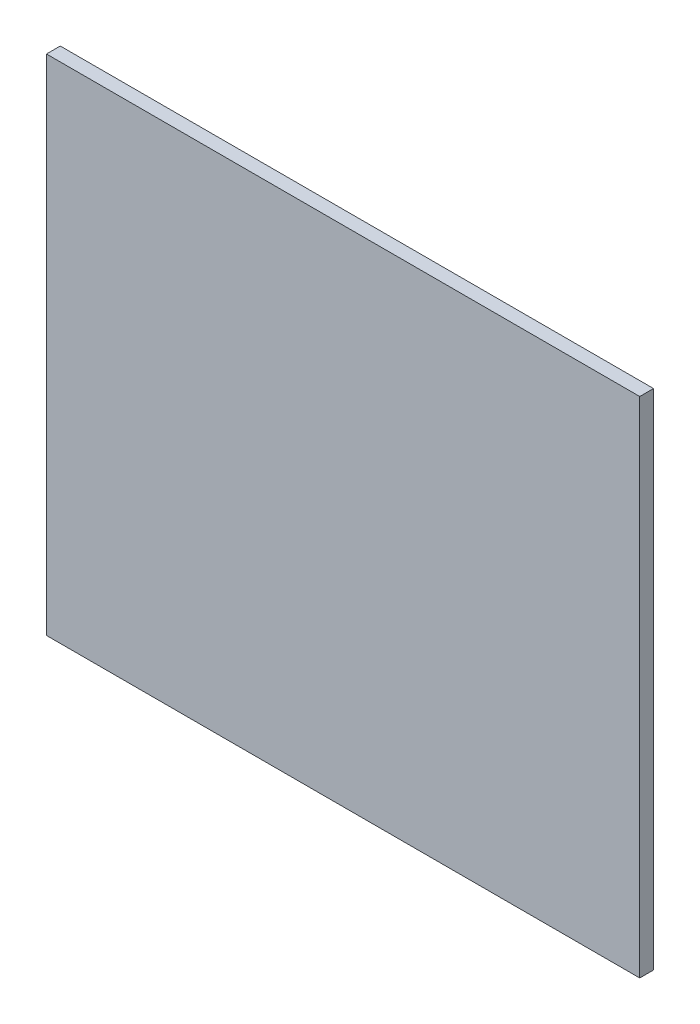
ISO-10303-21;
HEADER;
FILE_DESCRIPTION(('STEP AP214'),'2;1');
FILE_NAME('part.step','',(''),(''),'','','');
FILE_SCHEMA(('AUTOMOTIVE_DESIGN { 1 0 10303 214 1 1 1 1 }'));
ENDSEC;
DATA;
#1=APPLICATION_CONTEXT('core data for automotive mechanical design processes');
#2=APPLICATION_PROTOCOL_DEFINITION('international standard','automotive_design',2000,#1);
#3=PRODUCT_CONTEXT('',#1,'mechanical');
#4=PRODUCT('Part','Part','',(#3));
#5=PRODUCT_RELATED_PRODUCT_CATEGORY('part','',(#4));
#6=PRODUCT_DEFINITION_FORMATION('','',#4);
#7=PRODUCT_DEFINITION_CONTEXT('part definition',#1,'design');
#8=PRODUCT_DEFINITION('design','',#6,#7);
#9=PRODUCT_DEFINITION_SHAPE('','',#8);
#10=(LENGTH_UNIT() NAMED_UNIT(*) SI_UNIT(.MILLI.,.METRE.));
#11=(NAMED_UNIT(*) PLANE_ANGLE_UNIT() SI_UNIT($,.RADIAN.));
#12=(NAMED_UNIT(*) SI_UNIT($,.STERADIAN.) SOLID_ANGLE_UNIT());
#13=UNCERTAINTY_MEASURE_WITH_UNIT(LENGTH_MEASURE(1.E-05),#10,'distance_accuracy_value','');
#14=(GEOMETRIC_REPRESENTATION_CONTEXT(3) GLOBAL_UNCERTAINTY_ASSIGNED_CONTEXT((#13)) GLOBAL_UNIT_ASSIGNED_CONTEXT((#10,
#11,#12)) REPRESENTATION_CONTEXT('',''));
#15=CARTESIAN_POINT('',(0.,0.,0.));
#16=DIRECTION('',(0.,0.,1.));
#17=DIRECTION('',(1.,0.,0.));
#18=AXIS2_PLACEMENT_3D('',#15,#16,#17);
#19=CARTESIAN_POINT('',(2.15,0.,0.05));
#20=DIRECTION('',(-1.,0.,0.));
#21=DIRECTION('',(0.,0.,1.));
#22=AXIS2_PLACEMENT_3D('',#19,#20,#21);
#23=PLANE('',#22);
#24=DIRECTION('',(0.,0.,-1.));
#25=VECTOR('',#24,1.);
#26=CARTESIAN_POINT('',(2.15,-1.825,0.05));
#27=LINE('',#26,#25);
#28=CARTESIAN_POINT('',(2.15,-1.825,0.1));
#29=VERTEX_POINT('',#28);
#30=CARTESIAN_POINT('',(2.15,-1.825,0.));
#31=VERTEX_POINT('',#30);
#32=EDGE_CURVE('E72',#29,#31,#27,.T.);
#33=ORIENTED_EDGE('',*,*,#32,.T.);
#34=DIRECTION('',(0.,-1.,0.));
#35=VECTOR('',#34,1.);
#36=CARTESIAN_POINT('',(2.15,0.,0.));
#37=LINE('',#36,#35);
#38=CARTESIAN_POINT('',(2.15,1.825,0.));
#39=VERTEX_POINT('',#38);
#40=EDGE_CURVE('E115',#39,#31,#37,.T.);
#41=ORIENTED_EDGE('',*,*,#40,.F.);
#42=DIRECTION('',(0.,0.,-1.));
#43=VECTOR('',#42,1.);
#44=CARTESIAN_POINT('',(2.15,1.825,0.05));
#45=LINE('',#44,#43);
#46=CARTESIAN_POINT('',(2.15,1.825,0.1));
#47=VERTEX_POINT('',#46);
#48=EDGE_CURVE('E11',#47,#39,#45,.T.);
#49=ORIENTED_EDGE('',*,*,#48,.F.);
#50=DIRECTION('',(0.,1.,0.));
#51=VECTOR('',#50,1.);
#52=CARTESIAN_POINT('',(2.15,0.,0.1));
#53=LINE('',#52,#51);
#54=EDGE_CURVE('E85',#29,#47,#53,.T.);
#55=ORIENTED_EDGE('',*,*,#54,.F.);
#56=EDGE_LOOP('',(#33,#41,#49,#55));
#57=FACE_BOUND('',#56,.T.);
#58=ADVANCED_FACE('F16',(#57),#23,.F.);
#59=CARTESIAN_POINT('',(0.,1.825,0.05));
#60=DIRECTION('',(0.,-1.,0.));
#61=DIRECTION('',(0.,0.,-1.));
#62=AXIS2_PLACEMENT_3D('',#59,#60,#61);
#63=PLANE('',#62);
#64=ORIENTED_EDGE('',*,*,#48,.T.);
#65=DIRECTION('',(1.,0.,0.));
#66=VECTOR('',#65,1.);
#67=CARTESIAN_POINT('',(0.,1.825,0.));
#68=LINE('',#67,#66);
#69=CARTESIAN_POINT('',(-2.15,1.825,0.));
#70=VERTEX_POINT('',#69);
#71=EDGE_CURVE('E69',#70,#39,#68,.T.);
#72=ORIENTED_EDGE('',*,*,#71,.F.);
#73=DIRECTION('',(0.,0.,-1.));
#74=VECTOR('',#73,1.);
#75=CARTESIAN_POINT('',(-2.15,1.825,0.05));
#76=LINE('',#75,#74);
#77=CARTESIAN_POINT('',(-2.15,1.825,0.1));
#78=VERTEX_POINT('',#77);
#79=EDGE_CURVE('E26',#78,#70,#76,.T.);
#80=ORIENTED_EDGE('',*,*,#79,.F.);
#81=DIRECTION('',(-1.,0.,0.));
#82=VECTOR('',#81,1.);
#83=CARTESIAN_POINT('',(0.,1.825,0.1));
#84=LINE('',#83,#82);
#85=EDGE_CURVE('E66',#47,#78,#84,.T.);
#86=ORIENTED_EDGE('',*,*,#85,.F.);
#87=EDGE_LOOP('',(#64,#72,#80,#86));
#88=FACE_BOUND('',#87,.T.);
#89=ADVANCED_FACE('F64',(#88),#63,.F.);
#90=CARTESIAN_POINT('',(-2.15,0.,0.05));
#91=DIRECTION('',(1.,0.,0.));
#92=DIRECTION('',(0.,1.,0.));
#93=AXIS2_PLACEMENT_3D('',#90,#91,#92);
#94=PLANE('',#93);
#95=ORIENTED_EDGE('',*,*,#79,.T.);
#96=DIRECTION('',(0.,1.,0.));
#97=VECTOR('',#96,1.);
#98=CARTESIAN_POINT('',(-2.15,0.,0.));
#99=LINE('',#98,#97);
#100=CARTESIAN_POINT('',(-2.15,-1.825,0.));
#101=VERTEX_POINT('',#100);
#102=EDGE_CURVE('E95',#101,#70,#99,.T.);
#103=ORIENTED_EDGE('',*,*,#102,.F.);
#104=DIRECTION('',(0.,0.,-1.));
#105=VECTOR('',#104,1.);
#106=CARTESIAN_POINT('',(-2.15,-1.825,0.05));
#107=LINE('',#106,#105);
#108=CARTESIAN_POINT('',(-2.15,-1.825,0.1));
#109=VERTEX_POINT('',#108);
#110=EDGE_CURVE('E19',#109,#101,#107,.T.);
#111=ORIENTED_EDGE('',*,*,#110,.F.);
#112=DIRECTION('',(0.,-1.,0.));
#113=VECTOR('',#112,1.);
#114=CARTESIAN_POINT('',(-2.15,0.,0.1));
#115=LINE('',#114,#113);
#116=EDGE_CURVE('E75',#78,#109,#115,.T.);
#117=ORIENTED_EDGE('',*,*,#116,.F.);
#118=EDGE_LOOP('',(#95,#103,#111,#117));
#119=FACE_BOUND('',#118,.T.);
#120=ADVANCED_FACE('F76',(#119),#94,.F.);
#121=CARTESIAN_POINT('',(0.,-1.825,0.05));
#122=DIRECTION('',(0.,1.,0.));
#123=DIRECTION('',(1.,0.,0.));
#124=AXIS2_PLACEMENT_3D('',#121,#122,#123);
#125=PLANE('',#124);
#126=ORIENTED_EDGE('',*,*,#110,.T.);
#127=DIRECTION('',(-1.,0.,0.));
#128=VECTOR('',#127,1.);
#129=CARTESIAN_POINT('',(0.,-1.825,0.));
#130=LINE('',#129,#128);
#131=EDGE_CURVE('E109',#31,#101,#130,.T.);
#132=ORIENTED_EDGE('',*,*,#131,.F.);
#133=ORIENTED_EDGE('',*,*,#32,.F.);
#134=DIRECTION('',(1.,0.,0.));
#135=VECTOR('',#134,1.);
#136=CARTESIAN_POINT('',(0.,-1.825,0.1));
#137=LINE('',#136,#135);
#138=EDGE_CURVE('E81',#109,#29,#137,.T.);
#139=ORIENTED_EDGE('',*,*,#138,.F.);
#140=EDGE_LOOP('',(#126,#132,#133,#139));
#141=FACE_BOUND('',#140,.T.);
#142=ADVANCED_FACE('F107',(#141),#125,.F.);
#143=CARTESIAN_POINT('',(0.,0.,0.));
#144=DIRECTION('',(0.,0.,1.));
#145=DIRECTION('',(1.,0.,0.));
#146=AXIS2_PLACEMENT_3D('',#143,#144,#145);
#147=PLANE('',#146);
#148=ORIENTED_EDGE('',*,*,#40,.T.);
#149=ORIENTED_EDGE('',*,*,#131,.T.);
#150=ORIENTED_EDGE('',*,*,#102,.T.);
#151=ORIENTED_EDGE('',*,*,#71,.T.);
#152=EDGE_LOOP('',(#148,#149,#150,#151));
#153=FACE_BOUND('',#152,.T.);
#154=ADVANCED_FACE('F114',(#153),#147,.F.);
#155=CARTESIAN_POINT('',(0.,0.,0.1));
#156=DIRECTION('',(0.,0.,1.));
#157=DIRECTION('',(1.,0.,0.));
#158=AXIS2_PLACEMENT_3D('',#155,#156,#157);
#159=PLANE('',#158);
#160=ORIENTED_EDGE('',*,*,#54,.T.);
#161=ORIENTED_EDGE('',*,*,#85,.T.);
#162=ORIENTED_EDGE('',*,*,#116,.T.);
#163=ORIENTED_EDGE('',*,*,#138,.T.);
#164=EDGE_LOOP('',(#160,#161,#162,#163));
#165=FACE_BOUND('',#164,.T.);
#166=ADVANCED_FACE('F83',(#165),#159,.T.);
#167=CLOSED_SHELL('',(#58,#89,#120,#142,#154,#166));
#168=MANIFOLD_SOLID_BREP('B1',#167);
#169=ADVANCED_BREP_SHAPE_REPRESENTATION('',(#18,#168),#14);
#170=SHAPE_DEFINITION_REPRESENTATION(#9,#169);
ENDSEC;
END-ISO-10303-21;
